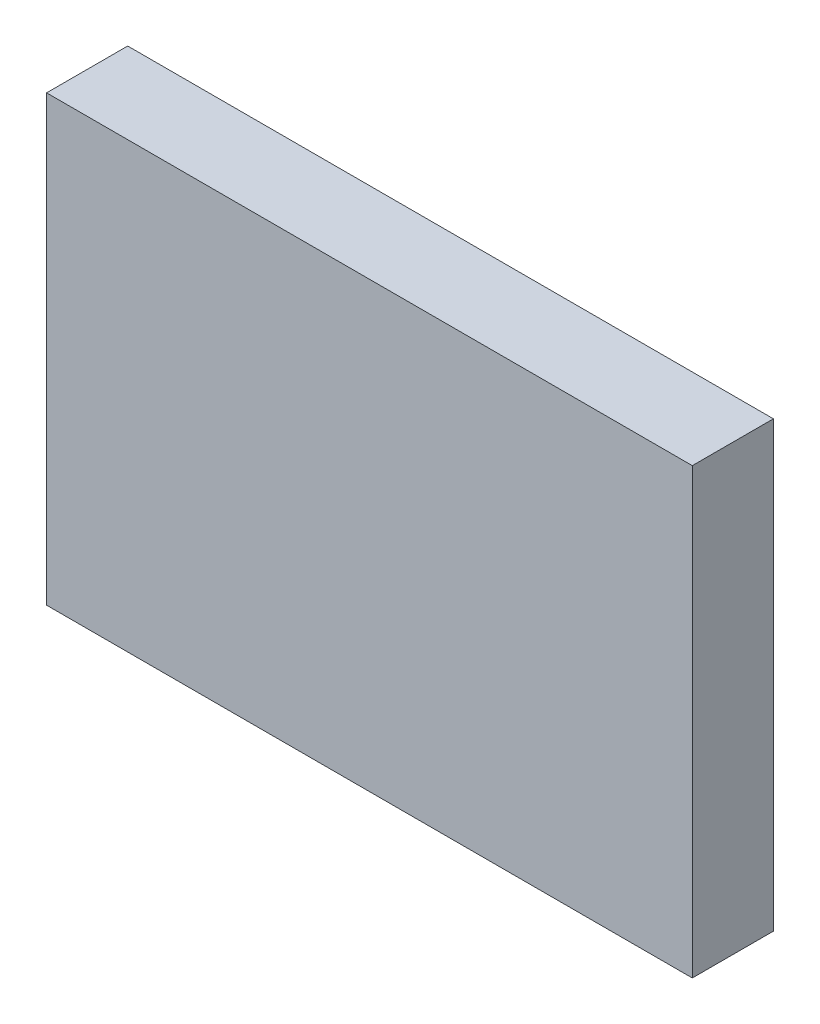
ISO-10303-21;
HEADER;
FILE_DESCRIPTION(('STEP AP214'),'2;1');
FILE_NAME('part.step','',(''),(''),'','','');
FILE_SCHEMA(('AUTOMOTIVE_DESIGN { 1 0 10303 214 1 1 1 1 }'));
ENDSEC;
DATA;
#1=APPLICATION_CONTEXT('core data for automotive mechanical design processes');
#2=APPLICATION_PROTOCOL_DEFINITION('international standard','automotive_design',2000,#1);
#3=PRODUCT_CONTEXT('',#1,'mechanical');
#4=PRODUCT('Part','Part','',(#3));
#5=PRODUCT_RELATED_PRODUCT_CATEGORY('part','',(#4));
#6=PRODUCT_DEFINITION_FORMATION('','',#4);
#7=PRODUCT_DEFINITION_CONTEXT('part definition',#1,'design');
#8=PRODUCT_DEFINITION('design','',#6,#7);
#9=PRODUCT_DEFINITION_SHAPE('','',#8);
#10=(LENGTH_UNIT() NAMED_UNIT(*) SI_UNIT(.MILLI.,.METRE.));
#11=(NAMED_UNIT(*) PLANE_ANGLE_UNIT() SI_UNIT($,.RADIAN.));
#12=(NAMED_UNIT(*) SI_UNIT($,.STERADIAN.) SOLID_ANGLE_UNIT());
#13=UNCERTAINTY_MEASURE_WITH_UNIT(LENGTH_MEASURE(1.E-05),#10,'distance_accuracy_value','');
#14=(GEOMETRIC_REPRESENTATION_CONTEXT(3) GLOBAL_UNCERTAINTY_ASSIGNED_CONTEXT((#13)) GLOBAL_UNIT_ASSIGNED_CONTEXT((#10,
#11,#12)) REPRESENTATION_CONTEXT('',''));
#15=CARTESIAN_POINT('',(0.,0.,0.));
#16=DIRECTION('',(0.,0.,1.));
#17=DIRECTION('',(1.,0.,0.));
#18=AXIS2_PLACEMENT_3D('',#15,#16,#17);
#19=CARTESIAN_POINT('',(1.143,0.775,0.));
#20=DIRECTION('',(0.,-1.,0.));
#21=DIRECTION('',(0.,0.,-1.));
#22=AXIS2_PLACEMENT_3D('',#19,#20,#21);
#23=PLANE('',#22);
#24=DIRECTION('',(-1.,0.,0.));
#25=VECTOR('',#24,1.);
#26=CARTESIAN_POINT('',(1.549,0.775,0.));
#27=LINE('',#26,#25);
#28=CARTESIAN_POINT('',(1.549,0.775,0.));
#29=VERTEX_POINT('',#28);
#30=CARTESIAN_POINT('',(1.143,0.775,0.));
#31=VERTEX_POINT('',#30);
#32=EDGE_CURVE('E11',#29,#31,#27,.T.);
#33=ORIENTED_EDGE('',*,*,#32,.F.);
#34=DIRECTION('',(0.,0.,-1.));
#35=VECTOR('',#34,1.);
#36=CARTESIAN_POINT('',(1.549,0.775,0.051));
#37=LINE('',#36,#35);
#38=CARTESIAN_POINT('',(1.549,0.775,0.051));
#39=VERTEX_POINT('',#38);
#40=EDGE_CURVE('E24',#39,#29,#37,.T.);
#41=ORIENTED_EDGE('',*,*,#40,.F.);
#42=DIRECTION('',(1.,0.,0.));
#43=VECTOR('',#42,1.);
#44=CARTESIAN_POINT('',(1.143,0.775,0.051));
#45=LINE('',#44,#43);
#46=CARTESIAN_POINT('',(1.143,0.775,0.051));
#47=VERTEX_POINT('',#46);
#48=EDGE_CURVE('E88',#47,#39,#45,.T.);
#49=ORIENTED_EDGE('',*,*,#48,.F.);
#50=DIRECTION('',(0.,0.,1.));
#51=VECTOR('',#50,1.);
#52=CARTESIAN_POINT('',(1.143,0.775,0.));
#53=LINE('',#52,#51);
#54=EDGE_CURVE('E77',#31,#47,#53,.T.);
#55=ORIENTED_EDGE('',*,*,#54,.F.);
#56=EDGE_LOOP('',(#33,#41,#49,#55));
#57=FACE_BOUND('',#56,.T.);
#58=ADVANCED_FACE('F17',(#57),#23,.T.);
#59=CARTESIAN_POINT('',(1.549,0.775,0.));
#60=DIRECTION('',(1.,0.,0.));
#61=DIRECTION('',(0.,1.,0.));
#62=AXIS2_PLACEMENT_3D('',#59,#60,#61);
#63=PLANE('',#62);
#64=DIRECTION('',(0.,-1.,0.));
#65=VECTOR('',#64,1.);
#66=CARTESIAN_POINT('',(1.549,1.054,0.));
#67=LINE('',#66,#65);
#68=CARTESIAN_POINT('',(1.549,1.054,0.));
#69=VERTEX_POINT('',#68);
#70=EDGE_CURVE('E85',#69,#29,#67,.T.);
#71=ORIENTED_EDGE('',*,*,#70,.F.);
#72=DIRECTION('',(0.,0.,-1.));
#73=VECTOR('',#72,1.);
#74=CARTESIAN_POINT('',(1.549,1.054,0.051));
#75=LINE('',#74,#73);
#76=CARTESIAN_POINT('',(1.549,1.054,0.051));
#77=VERTEX_POINT('',#76);
#78=EDGE_CURVE('E83',#77,#69,#75,.T.);
#79=ORIENTED_EDGE('',*,*,#78,.F.);
#80=DIRECTION('',(0.,1.,0.));
#81=VECTOR('',#80,1.);
#82=CARTESIAN_POINT('',(1.549,0.775,0.051));
#83=LINE('',#82,#81);
#84=EDGE_CURVE('E72',#39,#77,#83,.T.);
#85=ORIENTED_EDGE('',*,*,#84,.F.);
#86=ORIENTED_EDGE('',*,*,#40,.T.);
#87=EDGE_LOOP('',(#71,#79,#85,#86));
#88=FACE_BOUND('',#87,.T.);
#89=ADVANCED_FACE('F90',(#88),#63,.T.);
#90=CARTESIAN_POINT('',(1.549,1.054,0.));
#91=DIRECTION('',(0.,1.,0.));
#92=DIRECTION('',(1.,0.,0.));
#93=AXIS2_PLACEMENT_3D('',#90,#91,#92);
#94=PLANE('',#93);
#95=DIRECTION('',(1.,0.,0.));
#96=VECTOR('',#95,1.);
#97=CARTESIAN_POINT('',(1.143,1.054,0.));
#98=LINE('',#97,#96);
#99=CARTESIAN_POINT('',(1.143,1.054,0.));
#100=VERTEX_POINT('',#99);
#101=EDGE_CURVE('E60',#100,#69,#98,.T.);
#102=ORIENTED_EDGE('',*,*,#101,.F.);
#103=DIRECTION('',(0.,0.,-1.));
#104=VECTOR('',#103,1.);
#105=CARTESIAN_POINT('',(1.143,1.054,0.051));
#106=LINE('',#105,#104);
#107=CARTESIAN_POINT('',(1.143,1.054,0.051));
#108=VERTEX_POINT('',#107);
#109=EDGE_CURVE('E54',#108,#100,#106,.T.);
#110=ORIENTED_EDGE('',*,*,#109,.F.);
#111=DIRECTION('',(-1.,0.,0.));
#112=VECTOR('',#111,1.);
#113=CARTESIAN_POINT('',(1.549,1.054,0.051));
#114=LINE('',#113,#112);
#115=EDGE_CURVE('E58',#77,#108,#114,.T.);
#116=ORIENTED_EDGE('',*,*,#115,.F.);
#117=ORIENTED_EDGE('',*,*,#78,.T.);
#118=EDGE_LOOP('',(#102,#110,#116,#117));
#119=FACE_BOUND('',#118,.T.);
#120=ADVANCED_FACE('F56',(#119),#94,.T.);
#121=CARTESIAN_POINT('',(1.143,1.054,0.));
#122=DIRECTION('',(-1.,0.,0.));
#123=DIRECTION('',(0.,0.,1.));
#124=AXIS2_PLACEMENT_3D('',#121,#122,#123);
#125=PLANE('',#124);
#126=DIRECTION('',(0.,1.,0.));
#127=VECTOR('',#126,1.);
#128=CARTESIAN_POINT('',(1.143,0.775,0.));
#129=LINE('',#128,#127);
#130=EDGE_CURVE('E73',#31,#100,#129,.T.);
#131=ORIENTED_EDGE('',*,*,#130,.F.);
#132=ORIENTED_EDGE('',*,*,#54,.T.);
#133=DIRECTION('',(0.,-1.,0.));
#134=VECTOR('',#133,1.);
#135=CARTESIAN_POINT('',(1.143,1.054,0.051));
#136=LINE('',#135,#134);
#137=EDGE_CURVE('E70',#108,#47,#136,.T.);
#138=ORIENTED_EDGE('',*,*,#137,.F.);
#139=ORIENTED_EDGE('',*,*,#109,.T.);
#140=EDGE_LOOP('',(#131,#132,#138,#139));
#141=FACE_BOUND('',#140,.T.);
#142=ADVANCED_FACE('F76',(#141),#125,.T.);
#143=CARTESIAN_POINT('',(1.143,1.054,0.));
#144=DIRECTION('',(0.,0.,-1.));
#145=DIRECTION('',(0.,-1.,0.));
#146=AXIS2_PLACEMENT_3D('',#143,#144,#145);
#147=PLANE('',#146);
#148=ORIENTED_EDGE('',*,*,#101,.T.);
#149=ORIENTED_EDGE('',*,*,#70,.T.);
#150=ORIENTED_EDGE('',*,*,#32,.T.);
#151=ORIENTED_EDGE('',*,*,#130,.T.);
#152=EDGE_LOOP('',(#148,#149,#150,#151));
#153=FACE_BOUND('',#152,.T.);
#154=ADVANCED_FACE('F91',(#153),#147,.T.);
#155=CARTESIAN_POINT('',(1.143,0.775,0.051));
#156=DIRECTION('',(0.,0.,1.));
#157=DIRECTION('',(1.,0.,0.));
#158=AXIS2_PLACEMENT_3D('',#155,#156,#157);
#159=PLANE('',#158);
#160=ORIENTED_EDGE('',*,*,#48,.T.);
#161=ORIENTED_EDGE('',*,*,#84,.T.);
#162=ORIENTED_EDGE('',*,*,#115,.T.);
#163=ORIENTED_EDGE('',*,*,#137,.T.);
#164=EDGE_LOOP('',(#160,#161,#162,#163));
#165=FACE_BOUND('',#164,.T.);
#166=ADVANCED_FACE('F69',(#165),#159,.T.);
#167=CLOSED_SHELL('',(#58,#89,#120,#142,#154,#166));
#168=MANIFOLD_SOLID_BREP('B1',#167);
#169=ADVANCED_BREP_SHAPE_REPRESENTATION('',(#18,#168),#14);
#170=SHAPE_DEFINITION_REPRESENTATION(#9,#169);
ENDSEC;
END-ISO-10303-21;
